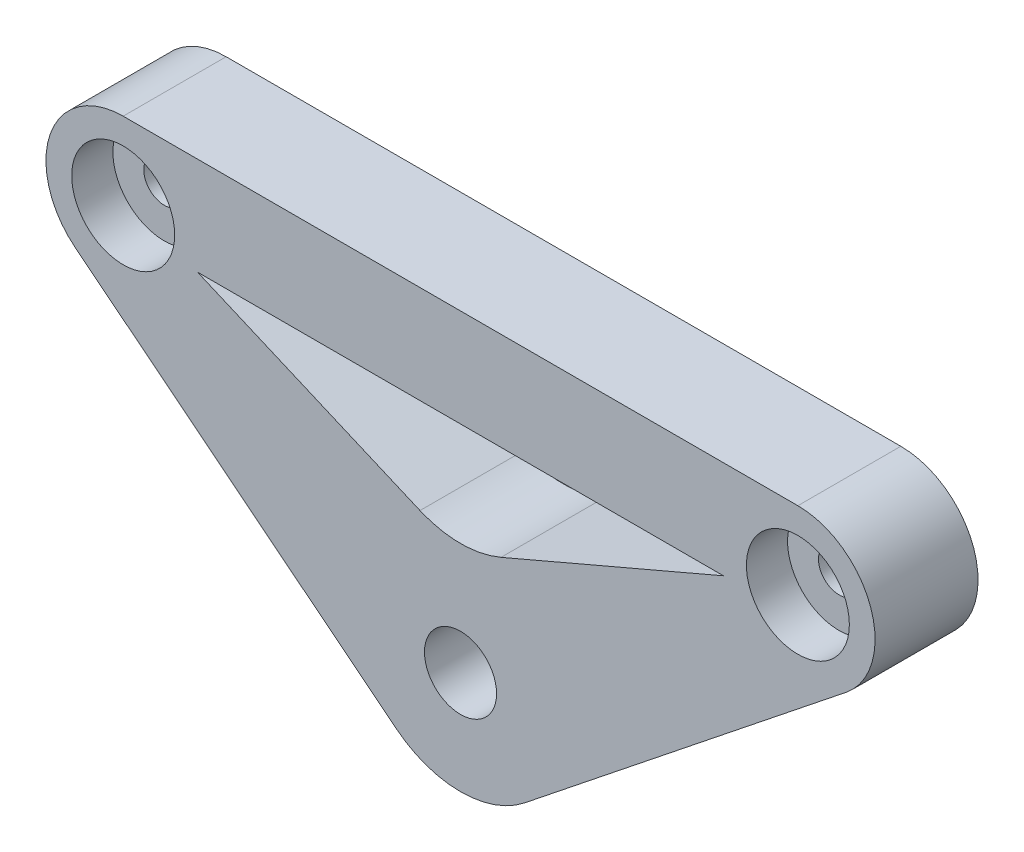
ISO-10303-21;
HEADER;
FILE_DESCRIPTION(('STEP AP214'),'2;1');
FILE_NAME('part.step','',(''),(''),'','','');
FILE_SCHEMA(('AUTOMOTIVE_DESIGN { 1 0 10303 214 1 1 1 1 }'));
ENDSEC;
DATA;
#1=APPLICATION_CONTEXT('core data for automotive mechanical design processes');
#2=APPLICATION_PROTOCOL_DEFINITION('international standard','automotive_design',2000,#1);
#3=PRODUCT_CONTEXT('',#1,'mechanical');
#4=PRODUCT('Part','Part','',(#3));
#5=PRODUCT_RELATED_PRODUCT_CATEGORY('part','',(#4));
#6=PRODUCT_DEFINITION_FORMATION('','',#4);
#7=PRODUCT_DEFINITION_CONTEXT('part definition',#1,'design');
#8=PRODUCT_DEFINITION('design','',#6,#7);
#9=PRODUCT_DEFINITION_SHAPE('','',#8);
#10=(LENGTH_UNIT() NAMED_UNIT(*) SI_UNIT(.MILLI.,.METRE.));
#11=(NAMED_UNIT(*) PLANE_ANGLE_UNIT() SI_UNIT($,.RADIAN.));
#12=(NAMED_UNIT(*) SI_UNIT($,.STERADIAN.) SOLID_ANGLE_UNIT());
#13=UNCERTAINTY_MEASURE_WITH_UNIT(LENGTH_MEASURE(1.E-05),#10,'distance_accuracy_value','');
#14=(GEOMETRIC_REPRESENTATION_CONTEXT(3) GLOBAL_UNCERTAINTY_ASSIGNED_CONTEXT((#13)) GLOBAL_UNIT_ASSIGNED_CONTEXT((#10,
#11,#12)) REPRESENTATION_CONTEXT('',''));
#15=CARTESIAN_POINT('',(0.,0.,0.));
#16=DIRECTION('',(0.,0.,1.));
#17=DIRECTION('',(1.,0.,0.));
#18=AXIS2_PLACEMENT_3D('',#15,#16,#17);
#19=CARTESIAN_POINT('',(32.7660817715596,22.9430574540419,10.));
#20=DIRECTION('',(0.,0.,-1.));
#21=DIRECTION('',(-1.,0.,0.));
#22=AXIS2_PLACEMENT_3D('',#19,#20,#21);
#23=CYLINDRICAL_SURFACE('',#22,2.);
#24=CARTESIAN_POINT('',(32.7660817715596,22.9430574540419,0.));
#25=DIRECTION('',(0.,0.,1.));
#26=DIRECTION('',(1.,0.,0.));
#27=AXIS2_PLACEMENT_3D('',#24,#25,#26);
#28=CIRCLE('',#27,2.);
#29=CARTESIAN_POINT('',(34.7660817715596,22.9430574540419,0.));
#30=VERTEX_POINT('',#29);
#31=EDGE_CURVE('E223',#30,#30,#28,.T.);
#32=ORIENTED_EDGE('',*,*,#31,.F.);
#33=EDGE_LOOP('',(#32));
#34=FACE_BOUND('',#33,.T.);
#35=CARTESIAN_POINT('',(32.7660817715596,22.9430574540419,6.));
#36=DIRECTION('',(0.,0.,1.));
#37=DIRECTION('',(1.,0.,0.));
#38=AXIS2_PLACEMENT_3D('',#35,#36,#37);
#39=CIRCLE('',#38,2.);
#40=CARTESIAN_POINT('',(34.7660817715596,22.9430574540419,6.));
#41=VERTEX_POINT('',#40);
#42=EDGE_CURVE('E45',#41,#41,#39,.T.);
#43=ORIENTED_EDGE('',*,*,#42,.T.);
#44=EDGE_LOOP('',(#43));
#45=FACE_BOUND('',#44,.T.);
#46=ADVANCED_FACE('F41',(#34,#45),#23,.F.);
#47=CARTESIAN_POINT('',(-32.7660817715596,22.9430574540419,10.));
#48=DIRECTION('',(0.,0.,-1.));
#49=DIRECTION('',(-1.,0.,0.));
#50=AXIS2_PLACEMENT_3D('',#47,#48,#49);
#51=CYLINDRICAL_SURFACE('',#50,2.);
#52=CARTESIAN_POINT('',(-32.7660817715596,22.9430574540419,0.));
#53=DIRECTION('',(0.,0.,1.));
#54=DIRECTION('',(1.,0.,0.));
#55=AXIS2_PLACEMENT_3D('',#52,#53,#54);
#56=CIRCLE('',#55,2.);
#57=CARTESIAN_POINT('',(-30.7660817715596,22.9430574540419,0.));
#58=VERTEX_POINT('',#57);
#59=EDGE_CURVE('E141',#58,#58,#56,.T.);
#60=ORIENTED_EDGE('',*,*,#59,.F.);
#61=EDGE_LOOP('',(#60));
#62=FACE_BOUND('',#61,.T.);
#63=CARTESIAN_POINT('',(-32.7660817715596,22.9430574540419,6.));
#64=DIRECTION('',(0.,0.,1.));
#65=DIRECTION('',(1.,0.,0.));
#66=AXIS2_PLACEMENT_3D('',#63,#64,#65);
#67=CIRCLE('',#66,2.);
#68=CARTESIAN_POINT('',(-30.7660817715596,22.9430574540419,6.));
#69=VERTEX_POINT('',#68);
#70=EDGE_CURVE('E174',#69,#69,#67,.T.);
#71=ORIENTED_EDGE('',*,*,#70,.T.);
#72=EDGE_LOOP('',(#71));
#73=FACE_BOUND('',#72,.T.);
#74=ADVANCED_FACE('F324',(#62,#73),#51,.F.);
#75=CARTESIAN_POINT('',(0.,0.,10.));
#76=DIRECTION('',(0.,0.,-1.));
#77=DIRECTION('',(-1.,0.,0.));
#78=AXIS2_PLACEMENT_3D('',#75,#76,#77);
#79=CYLINDRICAL_SURFACE('',#78,3.5);
#80=CARTESIAN_POINT('',(0.,0.,10.));
#81=DIRECTION('',(0.,0.,1.));
#82=DIRECTION('',(1.,0.,0.));
#83=AXIS2_PLACEMENT_3D('',#80,#81,#82);
#84=CIRCLE('',#83,3.5);
#85=CARTESIAN_POINT('',(3.5,0.,10.));
#86=VERTEX_POINT('',#85);
#87=EDGE_CURVE('E501',#86,#86,#84,.T.);
#88=ORIENTED_EDGE('',*,*,#87,.T.);
#89=EDGE_LOOP('',(#88));
#90=FACE_BOUND('',#89,.T.);
#91=CARTESIAN_POINT('',(0.,0.,5.));
#92=DIRECTION('',(0.,0.,-1.));
#93=DIRECTION('',(-1.,0.,0.));
#94=AXIS2_PLACEMENT_3D('',#91,#92,#93);
#95=CIRCLE('',#94,3.5);
#96=CARTESIAN_POINT('',(-3.5,0.,5.));
#97=VERTEX_POINT('',#96);
#98=EDGE_CURVE('E170',#97,#97,#95,.T.);
#99=ORIENTED_EDGE('',*,*,#98,.T.);
#100=EDGE_LOOP('',(#99));
#101=FACE_BOUND('',#100,.T.);
#102=ADVANCED_FACE('F329',(#90,#101),#79,.F.);
#103=CARTESIAN_POINT('',(-32.7660817715596,22.9430574540419,10.));
#104=DIRECTION('',(0.,0.,-1.));
#105=DIRECTION('',(-1.,0.,0.));
#106=AXIS2_PLACEMENT_3D('',#103,#104,#105);
#107=CYLINDRICAL_SURFACE('',#106,7.5);
#108=CARTESIAN_POINT('',(-32.7660817715596,22.9430574540419,0.));
#109=DIRECTION('',(0.,0.,1.));
#110=DIRECTION('',(1.,0.,0.));
#111=AXIS2_PLACEMENT_3D('',#108,#109,#110);
#112=CIRCLE('',#111,7.5);
#113=CARTESIAN_POINT('',(-32.7660817715596,30.4430574540419,0.));
#114=VERTEX_POINT('',#113);
#115=CARTESIAN_POINT('',(-37.4434723452321,17.0802921149447,0.));
#116=VERTEX_POINT('',#115);
#117=EDGE_CURVE('E218',#114,#116,#112,.T.);
#118=ORIENTED_EDGE('',*,*,#117,.T.);
#119=DIRECTION('',(0.,0.,-1.));
#120=VECTOR('',#119,1.);
#121=CARTESIAN_POINT('',(-37.4434723452321,17.0802921149447,10.));
#122=LINE('',#121,#120);
#123=CARTESIAN_POINT('',(-37.4434723452321,17.0802921149447,10.));
#124=VERTEX_POINT('',#123);
#125=EDGE_CURVE('E247',#124,#116,#122,.T.);
#126=ORIENTED_EDGE('',*,*,#125,.F.);
#127=CARTESIAN_POINT('',(-32.7660817715596,22.9430574540419,10.));
#128=DIRECTION('',(0.,0.,1.));
#129=DIRECTION('',(1.,0.,0.));
#130=AXIS2_PLACEMENT_3D('',#127,#128,#129);
#131=CIRCLE('',#130,7.5);
#132=CARTESIAN_POINT('',(-32.7660817715596,30.4430574540419,10.));
#133=VERTEX_POINT('',#132);
#134=EDGE_CURVE('E151',#133,#124,#131,.T.);
#135=ORIENTED_EDGE('',*,*,#134,.F.);
#136=DIRECTION('',(0.,0.,-1.));
#137=VECTOR('',#136,1.);
#138=CARTESIAN_POINT('',(-32.7660817715596,30.4430574540419,10.));
#139=LINE('',#138,#137);
#140=EDGE_CURVE('E131',#133,#114,#139,.T.);
#141=ORIENTED_EDGE('',*,*,#140,.T.);
#142=EDGE_LOOP('',(#118,#126,#135,#141));
#143=FACE_BOUND('',#142,.T.);
#144=ADVANCED_FACE('F304',(#143),#107,.T.);
#145=CARTESIAN_POINT('',(-6.2365207648966,-7.81702045212967,10.));
#146=DIRECTION('',(-0.62365207648966,-0.781702045212967,0.));
#147=DIRECTION('',(0.781702045212967,-0.62365207648966,0.));
#148=AXIS2_PLACEMENT_3D('',#145,#146,#147);
#149=PLANE('',#148);
#150=DIRECTION('',(-0.781702045212967,0.62365207648966,0.));
#151=VECTOR('',#150,1.);
#152=CARTESIAN_POINT('',(-6.2365207648966,-7.81702045212967,0.));
#153=LINE('',#152,#151);
#154=CARTESIAN_POINT('',(-6.2365207648966,-7.81702045212967,0.));
#155=VERTEX_POINT('',#154);
#156=EDGE_CURVE('E470',#155,#116,#153,.T.);
#157=ORIENTED_EDGE('',*,*,#156,.F.);
#158=DIRECTION('',(0.,0.,-1.));
#159=VECTOR('',#158,1.);
#160=CARTESIAN_POINT('',(-6.2365207648966,-7.81702045212967,10.));
#161=LINE('',#160,#159);
#162=CARTESIAN_POINT('',(-6.2365207648966,-7.81702045212967,10.));
#163=VERTEX_POINT('',#162);
#164=EDGE_CURVE('E244',#163,#155,#161,.T.);
#165=ORIENTED_EDGE('',*,*,#164,.F.);
#166=DIRECTION('',(-0.781702045212967,0.62365207648966,0.));
#167=VECTOR('',#166,1.);
#168=CARTESIAN_POINT('',(-6.2365207648966,-7.81702045212967,10.));
#169=LINE('',#168,#167);
#170=EDGE_CURVE('E531',#163,#124,#169,.T.);
#171=ORIENTED_EDGE('',*,*,#170,.T.);
#172=ORIENTED_EDGE('',*,*,#125,.T.);
#173=EDGE_LOOP('',(#157,#165,#171,#172));
#174=FACE_BOUND('',#173,.T.);
#175=ADVANCED_FACE('F447',(#174),#149,.T.);
#176=CARTESIAN_POINT('',(0.,0.,10.));
#177=DIRECTION('',(0.,0.,-1.));
#178=DIRECTION('',(-1.,0.,0.));
#179=AXIS2_PLACEMENT_3D('',#176,#177,#178);
#180=CYLINDRICAL_SURFACE('',#179,10.);
#181=CARTESIAN_POINT('',(0.,0.,0.));
#182=DIRECTION('',(0.,0.,1.));
#183=DIRECTION('',(1.,0.,0.));
#184=AXIS2_PLACEMENT_3D('',#181,#182,#183);
#185=CIRCLE('',#184,10.);
#186=CARTESIAN_POINT('',(6.2365207648966,-7.81702045212967,0.));
#187=VERTEX_POINT('',#186);
#188=EDGE_CURVE('E475',#155,#187,#185,.T.);
#189=ORIENTED_EDGE('',*,*,#188,.T.);
#190=DIRECTION('',(0.,0.,-1.));
#191=VECTOR('',#190,1.);
#192=CARTESIAN_POINT('',(6.2365207648966,-7.81702045212967,10.));
#193=LINE('',#192,#191);
#194=CARTESIAN_POINT('',(6.2365207648966,-7.81702045212967,10.));
#195=VERTEX_POINT('',#194);
#196=EDGE_CURVE('E240',#195,#187,#193,.T.);
#197=ORIENTED_EDGE('',*,*,#196,.F.);
#198=CARTESIAN_POINT('',(0.,0.,10.));
#199=DIRECTION('',(0.,0.,1.));
#200=DIRECTION('',(1.,0.,0.));
#201=AXIS2_PLACEMENT_3D('',#198,#199,#200);
#202=CIRCLE('',#201,10.);
#203=EDGE_CURVE('E503',#163,#195,#202,.T.);
#204=ORIENTED_EDGE('',*,*,#203,.F.);
#205=ORIENTED_EDGE('',*,*,#164,.T.);
#206=EDGE_LOOP('',(#189,#197,#204,#205));
#207=FACE_BOUND('',#206,.T.);
#208=ADVANCED_FACE('F278',(#207),#180,.T.);
#209=CARTESIAN_POINT('',(6.2365207648966,-7.81702045212967,10.));
#210=DIRECTION('',(-0.62365207648966,0.781702045212967,0.));
#211=DIRECTION('',(-0.781702045212967,-0.62365207648966,0.));
#212=AXIS2_PLACEMENT_3D('',#209,#210,#211);
#213=PLANE('',#212);
#214=DIRECTION('',(0.781702045212967,0.62365207648966,0.));
#215=VECTOR('',#214,1.);
#216=CARTESIAN_POINT('',(6.2365207648966,-7.81702045212967,0.));
#217=LINE('',#216,#215);
#218=CARTESIAN_POINT('',(37.4434723452321,17.0802921149447,0.));
#219=VERTEX_POINT('',#218);
#220=EDGE_CURVE('E479',#187,#219,#217,.T.);
#221=ORIENTED_EDGE('',*,*,#220,.T.);
#222=CARTESIAN_POINT('',(37.4434723452321,17.0802921149447,10.));
#223=DIRECTION('',(0.,0.,-1.));
#224=VECTOR('',#223,1.);
#225=LINE('',#222,#224);
#226=CARTESIAN_POINT('',(37.4434723452321,17.0802921149447,10.));
#227=VERTEX_POINT('',#226);
#228=EDGE_CURVE('E239',#227,#219,#225,.T.);
#229=ORIENTED_EDGE('',*,*,#228,.F.);
#230=DIRECTION('',(0.781702045212967,0.62365207648966,0.));
#231=VECTOR('',#230,1.);
#232=CARTESIAN_POINT('',(6.2365207648966,-7.81702045212967,10.));
#233=LINE('',#232,#231);
#234=EDGE_CURVE('E497',#195,#227,#233,.T.);
#235=ORIENTED_EDGE('',*,*,#234,.F.);
#236=ORIENTED_EDGE('',*,*,#196,.T.);
#237=EDGE_LOOP('',(#221,#229,#235,#236));
#238=FACE_BOUND('',#237,.T.);
#239=ADVANCED_FACE('F272',(#238),#213,.F.);
#240=CARTESIAN_POINT('',(32.7660817715596,22.9430574540419,10.));
#241=DIRECTION('',(0.,0.,-1.));
#242=DIRECTION('',(-1.,0.,0.));
#243=AXIS2_PLACEMENT_3D('',#240,#241,#242);
#244=CYLINDRICAL_SURFACE('',#243,7.5);
#245=CARTESIAN_POINT('',(32.7660817715596,22.9430574540419,0.));
#246=DIRECTION('',(0.,0.,1.));
#247=DIRECTION('',(1.,0.,0.));
#248=AXIS2_PLACEMENT_3D('',#245,#246,#247);
#249=CIRCLE('',#248,7.5);
#250=CARTESIAN_POINT('',(32.7660817715596,30.4430574540419,0.));
#251=VERTEX_POINT('',#250);
#252=EDGE_CURVE('E484',#219,#251,#249,.T.);
#253=ORIENTED_EDGE('',*,*,#252,.T.);
#254=DIRECTION('',(0.,0.,-1.));
#255=VECTOR('',#254,1.);
#256=CARTESIAN_POINT('',(32.7660817715596,30.4430574540419,10.));
#257=LINE('',#256,#255);
#258=CARTESIAN_POINT('',(32.7660817715596,30.4430574540419,10.));
#259=VERTEX_POINT('',#258);
#260=EDGE_CURVE('E236',#259,#251,#257,.T.);
#261=ORIENTED_EDGE('',*,*,#260,.F.);
#262=CARTESIAN_POINT('',(32.7660817715596,22.9430574540419,10.));
#263=DIRECTION('',(0.,0.,1.));
#264=DIRECTION('',(1.,0.,0.));
#265=AXIS2_PLACEMENT_3D('',#262,#263,#264);
#266=CIRCLE('',#265,7.5);
#267=EDGE_CURVE('E495',#227,#259,#266,.T.);
#268=ORIENTED_EDGE('',*,*,#267,.F.);
#269=ORIENTED_EDGE('',*,*,#228,.T.);
#270=EDGE_LOOP('',(#253,#261,#268,#269));
#271=FACE_BOUND('',#270,.T.);
#272=ADVANCED_FACE('F262',(#271),#244,.T.);
#273=CARTESIAN_POINT('',(3.61795218576484,8.45114792228896,10.));
#274=DIRECTION('',(0.393554580421959,0.919301252163237,0.));
#275=DIRECTION('',(-0.919301252163237,0.393554580421959,0.));
#276=AXIS2_PLACEMENT_3D('',#273,#274,#275);
#277=PLANE('',#276);
#278=DIRECTION('',(0.919301252163237,-0.393554580421959,0.));
#279=VECTOR('',#278,1.);
#280=CARTESIAN_POINT('',(3.61795218576484,8.45114792228896,10.));
#281=LINE('',#280,#279);
#282=CARTESIAN_POINT('',(-25.5402280584653,20.9338192608549,10.));
#283=VERTEX_POINT('',#282);
#284=CARTESIAN_POINT('',(-3.93554580421959,11.6848144980401,10.));
#285=VERTEX_POINT('',#284);
#286=EDGE_CURVE('E123',#283,#285,#281,.T.);
#287=ORIENTED_EDGE('',*,*,#286,.T.);
#288=DIRECTION('',(0.,0.,-1.));
#289=VECTOR('',#288,1.);
#290=CARTESIAN_POINT('',(-3.93554580421959,11.6848144980401,0.));
#291=LINE('',#290,#289);
#292=CARTESIAN_POINT('',(-3.93554580421959,11.6848144980401,0.));
#293=VERTEX_POINT('',#292);
#294=EDGE_CURVE('E167',#285,#293,#291,.T.);
#295=ORIENTED_EDGE('',*,*,#294,.T.);
#296=DIRECTION('',(0.919301252163237,-0.393554580421959,0.));
#297=VECTOR('',#296,1.);
#298=CARTESIAN_POINT('',(3.61795218576484,8.45114792228896,0.));
#299=LINE('',#298,#297);
#300=CARTESIAN_POINT('',(-25.5402280584653,20.9338192608549,0.));
#301=VERTEX_POINT('',#300);
#302=EDGE_CURVE('E125',#301,#293,#299,.T.);
#303=ORIENTED_EDGE('',*,*,#302,.F.);
#304=DIRECTION('',(0.,0.,-1.));
#305=VECTOR('',#304,1.);
#306=CARTESIAN_POINT('',(-25.5402280584653,20.9338192608549,10.));
#307=LINE('',#306,#305);
#308=EDGE_CURVE('E119',#283,#301,#307,.T.);
#309=ORIENTED_EDGE('',*,*,#308,.F.);
#310=EDGE_LOOP('',(#287,#295,#303,#309));
#311=FACE_BOUND('',#310,.T.);
#312=ADVANCED_FACE('F121',(#311),#277,.T.);
#313=CARTESIAN_POINT('',(0.,20.9338192608549,10.));
#314=DIRECTION('',(0.,-1.,0.));
#315=DIRECTION('',(1.,0.,0.));
#316=AXIS2_PLACEMENT_3D('',#313,#314,#315);
#317=PLANE('',#316);
#318=DIRECTION('',(-1.,0.,0.));
#319=VECTOR('',#318,1.);
#320=CARTESIAN_POINT('',(0.,20.9338192608549,0.));
#321=LINE('',#320,#319);
#322=CARTESIAN_POINT('',(25.5402280584653,20.9338192608549,0.));
#323=VERTEX_POINT('',#322);
#324=EDGE_CURVE('E515',#323,#301,#321,.T.);
#325=ORIENTED_EDGE('',*,*,#324,.F.);
#326=CARTESIAN_POINT('',(25.5402280584653,20.9338192608549,10.));
#327=DIRECTION('',(0.,0.,-1.));
#328=VECTOR('',#327,1.);
#329=LINE('',#326,#328);
#330=CARTESIAN_POINT('',(25.5402280584653,20.9338192608549,10.));
#331=VERTEX_POINT('',#330);
#332=EDGE_CURVE('E132',#331,#323,#329,.T.);
#333=ORIENTED_EDGE('',*,*,#332,.F.);
#334=DIRECTION('',(-1.,0.,0.));
#335=VECTOR('',#334,1.);
#336=CARTESIAN_POINT('',(0.,20.9338192608549,10.));
#337=LINE('',#336,#335);
#338=EDGE_CURVE('E138',#331,#283,#337,.T.);
#339=ORIENTED_EDGE('',*,*,#338,.T.);
#340=ORIENTED_EDGE('',*,*,#308,.T.);
#341=EDGE_LOOP('',(#325,#333,#339,#340));
#342=FACE_BOUND('',#341,.T.);
#343=ADVANCED_FACE('F144',(#342),#317,.T.);
#344=CARTESIAN_POINT('',(0.,30.4430574540419,10.));
#345=DIRECTION('',(0.,1.,0.));
#346=DIRECTION('',(-1.,0.,0.));
#347=AXIS2_PLACEMENT_3D('',#344,#345,#346);
#348=PLANE('',#347);
#349=DIRECTION('',(1.,0.,0.));
#350=VECTOR('',#349,1.);
#351=CARTESIAN_POINT('',(0.,30.4430574540419,0.));
#352=LINE('',#351,#350);
#353=EDGE_CURVE('E230',#114,#251,#352,.T.);
#354=ORIENTED_EDGE('',*,*,#353,.F.);
#355=ORIENTED_EDGE('',*,*,#140,.F.);
#356=DIRECTION('',(1.,0.,0.));
#357=VECTOR('',#356,1.);
#358=CARTESIAN_POINT('',(0.,30.4430574540419,10.));
#359=LINE('',#358,#357);
#360=EDGE_CURVE('E494',#133,#259,#359,.T.);
#361=ORIENTED_EDGE('',*,*,#360,.T.);
#362=ORIENTED_EDGE('',*,*,#260,.T.);
#363=EDGE_LOOP('',(#354,#355,#361,#362));
#364=FACE_BOUND('',#363,.T.);
#365=ADVANCED_FACE('F273',(#364),#348,.T.);
#366=CARTESIAN_POINT('',(-3.61795218576485,8.45114792228896,10.));
#367=DIRECTION('',(-0.393554580421959,0.919301252163237,0.));
#368=DIRECTION('',(-0.919301252163237,-0.393554580421959,0.));
#369=AXIS2_PLACEMENT_3D('',#366,#367,#368);
#370=PLANE('',#369);
#371=DIRECTION('',(0.919301252163237,0.393554580421959,0.));
#372=VECTOR('',#371,1.);
#373=CARTESIAN_POINT('',(-3.61795218576485,8.45114792228896,0.));
#374=LINE('',#373,#372);
#375=CARTESIAN_POINT('',(3.93554580421959,11.6848144980401,0.));
#376=VERTEX_POINT('',#375);
#377=EDGE_CURVE('E162',#376,#323,#374,.T.);
#378=ORIENTED_EDGE('',*,*,#377,.F.);
#379=DIRECTION('',(0.,0.,-1.));
#380=VECTOR('',#379,1.);
#381=CARTESIAN_POINT('',(3.93554580421959,11.6848144980401,10.));
#382=LINE('',#381,#380);
#383=CARTESIAN_POINT('',(3.93554580421959,11.6848144980401,10.));
#384=VERTEX_POINT('',#383);
#385=EDGE_CURVE('E59',#376,#384,#382,.F.);
#386=ORIENTED_EDGE('',*,*,#385,.T.);
#387=DIRECTION('',(0.919301252163237,0.393554580421959,0.));
#388=VECTOR('',#387,1.);
#389=CARTESIAN_POINT('',(-3.61795218576485,8.45114792228896,10.));
#390=LINE('',#389,#388);
#391=EDGE_CURVE('E148',#384,#331,#390,.T.);
#392=ORIENTED_EDGE('',*,*,#391,.T.);
#393=ORIENTED_EDGE('',*,*,#332,.T.);
#394=EDGE_LOOP('',(#378,#386,#392,#393));
#395=FACE_BOUND('',#394,.T.);
#396=ADVANCED_FACE('F294',(#395),#370,.T.);
#397=CARTESIAN_POINT('',(0.,0.,10.));
#398=DIRECTION('',(0.,0.,1.));
#399=DIRECTION('',(1.,0.,0.));
#400=AXIS2_PLACEMENT_3D('',#397,#398,#399);
#401=PLANE('',#400);
#402=CARTESIAN_POINT('',(-32.7660817715596,22.9430574540419,10.));
#403=DIRECTION('',(0.,0.,1.));
#404=DIRECTION('',(1.,0.,0.));
#405=AXIS2_PLACEMENT_3D('',#402,#403,#404);
#406=CIRCLE('',#405,5.);
#407=CARTESIAN_POINT('',(-27.7660817715596,22.9430574540419,10.));
#408=VERTEX_POINT('',#407);
#409=EDGE_CURVE('E185',#408,#408,#406,.T.);
#410=ORIENTED_EDGE('',*,*,#409,.F.);
#411=EDGE_LOOP('',(#410));
#412=FACE_BOUND('',#411,.T.);
#413=CARTESIAN_POINT('',(32.7660817715596,22.9430574540419,10.));
#414=DIRECTION('',(0.,0.,1.));
#415=DIRECTION('',(1.,0.,0.));
#416=AXIS2_PLACEMENT_3D('',#413,#414,#415);
#417=CIRCLE('',#416,5.);
#418=CARTESIAN_POINT('',(37.7660817715596,22.9430574540419,10.));
#419=VERTEX_POINT('',#418);
#420=EDGE_CURVE('E197',#419,#419,#417,.T.);
#421=ORIENTED_EDGE('',*,*,#420,.F.);
#422=EDGE_LOOP('',(#421));
#423=FACE_BOUND('',#422,.T.);
#424=ORIENTED_EDGE('',*,*,#286,.F.);
#425=ORIENTED_EDGE('',*,*,#338,.F.);
#426=ORIENTED_EDGE('',*,*,#391,.F.);
#427=CARTESIAN_POINT('',(0.,20.8778270196725,10.));
#428=DIRECTION('',(0.,0.,1.));
#429=DIRECTION('',(1.,0.,0.));
#430=AXIS2_PLACEMENT_3D('',#427,#428,#429);
#431=CIRCLE('',#430,10.);
#432=EDGE_CURVE('E11',#384,#285,#431,.F.);
#433=ORIENTED_EDGE('',*,*,#432,.T.);
#434=EDGE_LOOP('',(#424,#425,#426,#433));
#435=FACE_BOUND('',#434,.T.);
#436=ORIENTED_EDGE('',*,*,#134,.T.);
#437=ORIENTED_EDGE('',*,*,#170,.F.);
#438=ORIENTED_EDGE('',*,*,#203,.T.);
#439=ORIENTED_EDGE('',*,*,#234,.T.);
#440=ORIENTED_EDGE('',*,*,#267,.T.);
#441=ORIENTED_EDGE('',*,*,#360,.F.);
#442=EDGE_LOOP('',(#436,#437,#438,#439,#440,#441));
#443=FACE_BOUND('',#442,.T.);
#444=ORIENTED_EDGE('',*,*,#87,.F.);
#445=EDGE_LOOP('',(#444));
#446=FACE_BOUND('',#445,.T.);
#447=ADVANCED_FACE('F136',(#412,#423,#435,#443,#446),#401,.T.);
#448=CARTESIAN_POINT('',(0.,0.,0.));
#449=DIRECTION('',(0.,0.,1.));
#450=DIRECTION('',(1.,0.,0.));
#451=AXIS2_PLACEMENT_3D('',#448,#449,#450);
#452=PLANE('',#451);
#453=CARTESIAN_POINT('',(0.,0.,0.));
#454=DIRECTION('',(0.,0.,-1.));
#455=DIRECTION('',(-1.,0.,0.));
#456=AXIS2_PLACEMENT_3D('',#453,#454,#455);
#457=CIRCLE('',#456,6.5);
#458=CARTESIAN_POINT('',(-6.5,0.,0.));
#459=VERTEX_POINT('',#458);
#460=EDGE_CURVE('E183',#459,#459,#457,.T.);
#461=ORIENTED_EDGE('',*,*,#460,.F.);
#462=EDGE_LOOP('',(#461));
#463=FACE_BOUND('',#462,.T.);
#464=ORIENTED_EDGE('',*,*,#302,.T.);
#465=CARTESIAN_POINT('',(0.,20.8778270196725,0.));
#466=DIRECTION('',(0.,0.,1.));
#467=DIRECTION('',(1.,0.,0.));
#468=AXIS2_PLACEMENT_3D('',#465,#466,#467);
#469=CIRCLE('',#468,10.);
#470=EDGE_CURVE('E51',#293,#376,#469,.T.);
#471=ORIENTED_EDGE('',*,*,#470,.T.);
#472=ORIENTED_EDGE('',*,*,#377,.T.);
#473=ORIENTED_EDGE('',*,*,#324,.T.);
#474=EDGE_LOOP('',(#464,#471,#472,#473));
#475=FACE_BOUND('',#474,.T.);
#476=ORIENTED_EDGE('',*,*,#117,.F.);
#477=ORIENTED_EDGE('',*,*,#353,.T.);
#478=ORIENTED_EDGE('',*,*,#252,.F.);
#479=ORIENTED_EDGE('',*,*,#220,.F.);
#480=ORIENTED_EDGE('',*,*,#188,.F.);
#481=ORIENTED_EDGE('',*,*,#156,.T.);
#482=EDGE_LOOP('',(#476,#477,#478,#479,#480,#481));
#483=FACE_BOUND('',#482,.T.);
#484=ORIENTED_EDGE('',*,*,#31,.T.);
#485=EDGE_LOOP('',(#484));
#486=FACE_BOUND('',#485,.T.);
#487=ORIENTED_EDGE('',*,*,#59,.T.);
#488=EDGE_LOOP('',(#487));
#489=FACE_BOUND('',#488,.T.);
#490=ADVANCED_FACE('F209',(#463,#475,#483,#486,#489),#452,.F.);
#491=CARTESIAN_POINT('',(0.,20.8778270196725,10.));
#492=DIRECTION('',(0.,0.,1.));
#493=DIRECTION('',(1.,0.,0.));
#494=AXIS2_PLACEMENT_3D('',#491,#492,#493);
#495=CYLINDRICAL_SURFACE('',#494,10.);
#496=ORIENTED_EDGE('',*,*,#432,.F.);
#497=ORIENTED_EDGE('',*,*,#385,.F.);
#498=ORIENTED_EDGE('',*,*,#470,.F.);
#499=ORIENTED_EDGE('',*,*,#294,.F.);
#500=EDGE_LOOP('',(#496,#497,#498,#499));
#501=FACE_BOUND('',#500,.T.);
#502=ADVANCED_FACE('F43',(#501),#495,.F.);
#503=CARTESIAN_POINT('',(0.,0.,5.));
#504=DIRECTION('',(0.,0.,-1.));
#505=DIRECTION('',(-1.,0.,0.));
#506=AXIS2_PLACEMENT_3D('',#503,#504,#505);
#507=CYLINDRICAL_SURFACE('',#506,6.5);
#508=CARTESIAN_POINT('',(0.,0.,5.));
#509=DIRECTION('',(0.,0.,-1.));
#510=DIRECTION('',(-1.,0.,0.));
#511=AXIS2_PLACEMENT_3D('',#508,#509,#510);
#512=CIRCLE('',#511,6.5);
#513=CARTESIAN_POINT('',(-6.5,0.,5.));
#514=VERTEX_POINT('',#513);
#515=EDGE_CURVE('E173',#514,#514,#512,.T.);
#516=ORIENTED_EDGE('',*,*,#515,.F.);
#517=EDGE_LOOP('',(#516));
#518=FACE_BOUND('',#517,.T.);
#519=ORIENTED_EDGE('',*,*,#460,.T.);
#520=EDGE_LOOP('',(#519));
#521=FACE_BOUND('',#520,.T.);
#522=ADVANCED_FACE('F207',(#518,#521),#507,.F.);
#523=CARTESIAN_POINT('',(0.,0.,5.));
#524=DIRECTION('',(0.,0.,-1.));
#525=DIRECTION('',(-1.,0.,0.));
#526=AXIS2_PLACEMENT_3D('',#523,#524,#525);
#527=PLANE('',#526);
#528=ORIENTED_EDGE('',*,*,#98,.F.);
#529=EDGE_LOOP('',(#528));
#530=FACE_BOUND('',#529,.T.);
#531=ORIENTED_EDGE('',*,*,#515,.T.);
#532=EDGE_LOOP('',(#531));
#533=FACE_BOUND('',#532,.T.);
#534=ADVANCED_FACE('F320',(#530,#533),#527,.T.);
#535=CARTESIAN_POINT('',(32.7660817715596,22.9430574540419,6.));
#536=DIRECTION('',(0.,0.,1.));
#537=DIRECTION('',(1.,0.,0.));
#538=AXIS2_PLACEMENT_3D('',#535,#536,#537);
#539=CYLINDRICAL_SURFACE('',#538,5.);
#540=CARTESIAN_POINT('',(32.7660817715596,22.9430574540419,6.));
#541=DIRECTION('',(0.,0.,1.));
#542=DIRECTION('',(1.,0.,0.));
#543=AXIS2_PLACEMENT_3D('',#540,#541,#542);
#544=CIRCLE('',#543,5.);
#545=CARTESIAN_POINT('',(37.7660817715596,22.9430574540419,6.));
#546=VERTEX_POINT('',#545);
#547=EDGE_CURVE('E191',#546,#546,#544,.T.);
#548=ORIENTED_EDGE('',*,*,#547,.F.);
#549=EDGE_LOOP('',(#548));
#550=FACE_BOUND('',#549,.T.);
#551=ORIENTED_EDGE('',*,*,#420,.T.);
#552=EDGE_LOOP('',(#551));
#553=FACE_BOUND('',#552,.T.);
#554=ADVANCED_FACE('F341',(#550,#553),#539,.F.);
#555=CARTESIAN_POINT('',(32.7660817715596,22.9430574540419,6.));
#556=DIRECTION('',(0.,0.,1.));
#557=DIRECTION('',(1.,0.,0.));
#558=AXIS2_PLACEMENT_3D('',#555,#556,#557);
#559=PLANE('',#558);
#560=ORIENTED_EDGE('',*,*,#42,.F.);
#561=EDGE_LOOP('',(#560));
#562=FACE_BOUND('',#561,.T.);
#563=ORIENTED_EDGE('',*,*,#547,.T.);
#564=EDGE_LOOP('',(#563));
#565=FACE_BOUND('',#564,.T.);
#566=ADVANCED_FACE('F345',(#562,#565),#559,.T.);
#567=CARTESIAN_POINT('',(-32.7660817715596,22.9430574540419,6.));
#568=DIRECTION('',(0.,0.,1.));
#569=DIRECTION('',(1.,0.,0.));
#570=AXIS2_PLACEMENT_3D('',#567,#568,#569);
#571=CYLINDRICAL_SURFACE('',#570,5.);
#572=CARTESIAN_POINT('',(-32.7660817715596,22.9430574540419,6.));
#573=DIRECTION('',(0.,0.,1.));
#574=DIRECTION('',(1.,0.,0.));
#575=AXIS2_PLACEMENT_3D('',#572,#573,#574);
#576=CIRCLE('',#575,5.);
#577=CARTESIAN_POINT('',(-27.7660817715596,22.9430574540419,6.));
#578=VERTEX_POINT('',#577);
#579=EDGE_CURVE('E177',#578,#578,#576,.T.);
#580=ORIENTED_EDGE('',*,*,#579,.F.);
#581=EDGE_LOOP('',(#580));
#582=FACE_BOUND('',#581,.T.);
#583=ORIENTED_EDGE('',*,*,#409,.T.);
#584=EDGE_LOOP('',(#583));
#585=FACE_BOUND('',#584,.T.);
#586=ADVANCED_FACE('F349',(#582,#585),#571,.F.);
#587=CARTESIAN_POINT('',(-32.7660817715596,22.9430574540419,6.));
#588=DIRECTION('',(0.,0.,1.));
#589=DIRECTION('',(1.,0.,0.));
#590=AXIS2_PLACEMENT_3D('',#587,#588,#589);
#591=PLANE('',#590);
#592=ORIENTED_EDGE('',*,*,#70,.F.);
#593=EDGE_LOOP('',(#592));
#594=FACE_BOUND('',#593,.T.);
#595=ORIENTED_EDGE('',*,*,#579,.T.);
#596=EDGE_LOOP('',(#595));
#597=FACE_BOUND('',#596,.T.);
#598=ADVANCED_FACE('F353',(#594,#597),#591,.T.);
#599=CLOSED_SHELL('',(#46,#74,#102,#144,#175,#208,#239,#272,#312,#343,#365,#396,#447,#490,#502,
#522,#534,#554,#566,#586,#598));
#600=MANIFOLD_SOLID_BREP('B2',#599);
#601=ADVANCED_BREP_SHAPE_REPRESENTATION('',(#18,#600),#14);
#602=SHAPE_DEFINITION_REPRESENTATION(#9,#601);
ENDSEC;
END-ISO-10303-21;
